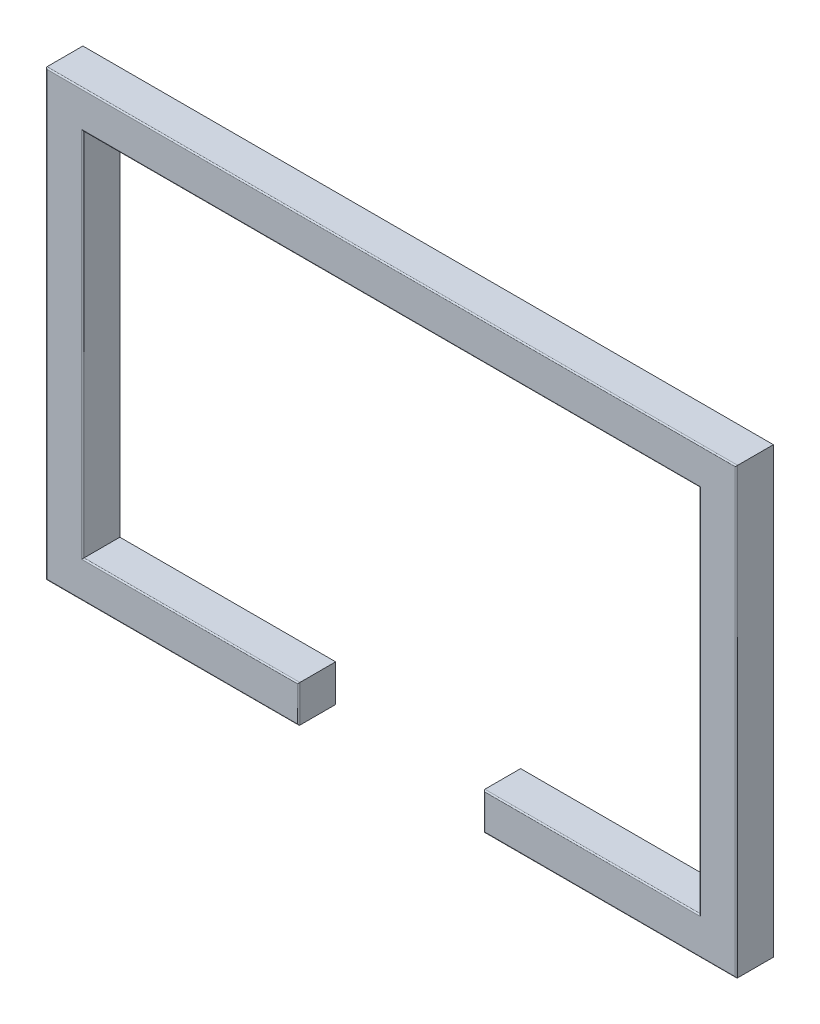
ISO-10303-21;
HEADER;
FILE_DESCRIPTION(('STEP AP214'),'2;1');
FILE_NAME('part.step','',(''),(''),'','','');
FILE_SCHEMA(('AUTOMOTIVE_DESIGN { 1 0 10303 214 1 1 1 1 }'));
ENDSEC;
DATA;
#1=APPLICATION_CONTEXT('core data for automotive mechanical design processes');
#2=APPLICATION_PROTOCOL_DEFINITION('international standard','automotive_design',2000,#1);
#3=PRODUCT_CONTEXT('',#1,'mechanical');
#4=PRODUCT('Part','Part','',(#3));
#5=PRODUCT_RELATED_PRODUCT_CATEGORY('part','',(#4));
#6=PRODUCT_DEFINITION_FORMATION('','',#4);
#7=PRODUCT_DEFINITION_CONTEXT('part definition',#1,'design');
#8=PRODUCT_DEFINITION('design','',#6,#7);
#9=PRODUCT_DEFINITION_SHAPE('','',#8);
#10=(LENGTH_UNIT() NAMED_UNIT(*) SI_UNIT(.MILLI.,.METRE.));
#11=(NAMED_UNIT(*) PLANE_ANGLE_UNIT() SI_UNIT($,.RADIAN.));
#12=(NAMED_UNIT(*) SI_UNIT($,.STERADIAN.) SOLID_ANGLE_UNIT());
#13=UNCERTAINTY_MEASURE_WITH_UNIT(LENGTH_MEASURE(1.E-05),#10,'distance_accuracy_value','');
#14=(GEOMETRIC_REPRESENTATION_CONTEXT(3) GLOBAL_UNCERTAINTY_ASSIGNED_CONTEXT((#13)) GLOBAL_UNIT_ASSIGNED_CONTEXT((#10,
#11,#12)) REPRESENTATION_CONTEXT('',''));
#15=CARTESIAN_POINT('',(0.,0.,0.));
#16=DIRECTION('',(0.,0.,1.));
#17=DIRECTION('',(1.,0.,0.));
#18=AXIS2_PLACEMENT_3D('',#15,#16,#17);
#19=CARTESIAN_POINT('',(75.,-150.,30.));
#20=DIRECTION('',(0.,-1.,0.));
#21=DIRECTION('',(0.,0.,-1.));
#22=AXIS2_PLACEMENT_3D('',#19,#20,#21);
#23=PLANE('',#22);
#24=DIRECTION('',(0.,0.,-1.));
#25=VECTOR('',#24,1.);
#26=CARTESIAN_POINT('',(75.,-150.,30.));
#27=LINE('',#26,#25);
#28=CARTESIAN_POINT('',(75.,-150.,29.));
#29=VERTEX_POINT('',#28);
#30=CARTESIAN_POINT('',(75.,-150.,0.));
#31=VERTEX_POINT('',#30);
#32=EDGE_CURVE('E158',#29,#31,#27,.T.);
#33=ORIENTED_EDGE('',*,*,#32,.F.);
#34=DIRECTION('',(-1.,0.,0.));
#35=VECTOR('',#34,1.);
#36=CARTESIAN_POINT('',(75.,-150.,29.));
#37=LINE('',#36,#35);
#38=CARTESIAN_POINT('',(250.,-150.,29.));
#39=VERTEX_POINT('',#38);
#40=EDGE_CURVE('E270',#29,#39,#37,.F.);
#41=ORIENTED_EDGE('',*,*,#40,.T.);
#42=DIRECTION('',(0.,0.,-1.));
#43=VECTOR('',#42,1.);
#44=CARTESIAN_POINT('',(250.,-150.,30.));
#45=LINE('',#44,#43);
#46=CARTESIAN_POINT('',(250.,-150.,0.));
#47=VERTEX_POINT('',#46);
#48=EDGE_CURVE('E182',#39,#47,#45,.T.);
#49=ORIENTED_EDGE('',*,*,#48,.T.);
#50=DIRECTION('',(-1.,0.,0.));
#51=VECTOR('',#50,1.);
#52=CARTESIAN_POINT('',(75.,-150.,0.));
#53=LINE('',#52,#51);
#54=EDGE_CURVE('E176',#47,#31,#53,.T.);
#55=ORIENTED_EDGE('',*,*,#54,.T.);
#56=EDGE_LOOP('',(#33,#41,#49,#55));
#57=FACE_BOUND('',#56,.T.);
#58=ADVANCED_FACE('F32',(#57),#23,.F.);
#59=CARTESIAN_POINT('',(75.,-180.,30.));
#60=DIRECTION('',(1.,0.,0.));
#61=DIRECTION('',(0.,0.,-1.));
#62=AXIS2_PLACEMENT_3D('',#59,#60,#61);
#63=PLANE('',#62);
#64=DIRECTION('',(0.,0.,-1.));
#65=VECTOR('',#64,1.);
#66=CARTESIAN_POINT('',(75.,-180.,30.));
#67=LINE('',#66,#65);
#68=CARTESIAN_POINT('',(75.,-180.,29.));
#69=VERTEX_POINT('',#68);
#70=CARTESIAN_POINT('',(75.,-180.,0.));
#71=VERTEX_POINT('',#70);
#72=EDGE_CURVE('E170',#69,#71,#67,.T.);
#73=ORIENTED_EDGE('',*,*,#72,.F.);
#74=DIRECTION('',(0.,-1.,0.));
#75=VECTOR('',#74,1.);
#76=CARTESIAN_POINT('',(75.,-180.,29.));
#77=LINE('',#76,#75);
#78=EDGE_CURVE('E165',#69,#29,#77,.F.);
#79=ORIENTED_EDGE('',*,*,#78,.T.);
#80=ORIENTED_EDGE('',*,*,#32,.T.);
#81=DIRECTION('',(0.,-1.,0.));
#82=VECTOR('',#81,1.);
#83=CARTESIAN_POINT('',(75.,-180.,0.));
#84=LINE('',#83,#82);
#85=EDGE_CURVE('E162',#31,#71,#84,.T.);
#86=ORIENTED_EDGE('',*,*,#85,.T.);
#87=EDGE_LOOP('',(#73,#79,#80,#86));
#88=FACE_BOUND('',#87,.T.);
#89=ADVANCED_FACE('F161',(#88),#63,.F.);
#90=CARTESIAN_POINT('',(75.,-180.,30.));
#91=DIRECTION('',(0.,1.,0.));
#92=DIRECTION('',(0.,0.,1.));
#93=AXIS2_PLACEMENT_3D('',#90,#91,#92);
#94=PLANE('',#93);
#95=DIRECTION('',(0.,0.,-1.));
#96=VECTOR('',#95,1.);
#97=CARTESIAN_POINT('',(280.,-180.,30.));
#98=LINE('',#97,#96);
#99=CARTESIAN_POINT('',(280.,-180.,29.));
#100=VERTEX_POINT('',#99);
#101=CARTESIAN_POINT('',(280.,-180.,0.));
#102=VERTEX_POINT('',#101);
#103=EDGE_CURVE('E232',#100,#102,#98,.T.);
#104=ORIENTED_EDGE('',*,*,#103,.F.);
#105=DIRECTION('',(1.,0.,0.));
#106=VECTOR('',#105,1.);
#107=CARTESIAN_POINT('',(75.,-180.,29.));
#108=LINE('',#107,#106);
#109=EDGE_CURVE('E275',#100,#69,#108,.F.);
#110=ORIENTED_EDGE('',*,*,#109,.T.);
#111=ORIENTED_EDGE('',*,*,#72,.T.);
#112=DIRECTION('',(1.,0.,0.));
#113=VECTOR('',#112,1.);
#114=CARTESIAN_POINT('',(75.,-180.,0.));
#115=LINE('',#114,#113);
#116=EDGE_CURVE('E179',#71,#102,#115,.T.);
#117=ORIENTED_EDGE('',*,*,#116,.T.);
#118=EDGE_LOOP('',(#104,#110,#111,#117));
#119=FACE_BOUND('',#118,.T.);
#120=ADVANCED_FACE('F356',(#119),#94,.F.);
#121=CARTESIAN_POINT('',(280.,180.,30.));
#122=DIRECTION('',(-1.,0.,0.));
#123=DIRECTION('',(0.,0.,1.));
#124=AXIS2_PLACEMENT_3D('',#121,#122,#123);
#125=PLANE('',#124);
#126=DIRECTION('',(0.,0.,-1.));
#127=VECTOR('',#126,1.);
#128=CARTESIAN_POINT('',(280.,180.,30.));
#129=LINE('',#128,#127);
#130=CARTESIAN_POINT('',(280.,180.,29.));
#131=VERTEX_POINT('',#130);
#132=CARTESIAN_POINT('',(280.,180.,0.));
#133=VERTEX_POINT('',#132);
#134=EDGE_CURVE('E230',#131,#133,#129,.T.);
#135=ORIENTED_EDGE('',*,*,#134,.F.);
#136=DIRECTION('',(0.,1.,0.));
#137=VECTOR('',#136,1.);
#138=CARTESIAN_POINT('',(280.,180.,29.));
#139=LINE('',#138,#137);
#140=EDGE_CURVE('E273',#131,#100,#139,.F.);
#141=ORIENTED_EDGE('',*,*,#140,.T.);
#142=ORIENTED_EDGE('',*,*,#103,.T.);
#143=DIRECTION('',(0.,1.,0.));
#144=VECTOR('',#143,1.);
#145=CARTESIAN_POINT('',(280.,180.,0.));
#146=LINE('',#145,#144);
#147=EDGE_CURVE('E189',#102,#133,#146,.T.);
#148=ORIENTED_EDGE('',*,*,#147,.T.);
#149=EDGE_LOOP('',(#135,#141,#142,#148));
#150=FACE_BOUND('',#149,.T.);
#151=ADVANCED_FACE('F432',(#150),#125,.F.);
#152=CARTESIAN_POINT('',(-280.,180.,30.));
#153=DIRECTION('',(0.,-1.,0.));
#154=DIRECTION('',(0.,0.,-1.));
#155=AXIS2_PLACEMENT_3D('',#152,#153,#154);
#156=PLANE('',#155);
#157=DIRECTION('',(0.,0.,-1.));
#158=VECTOR('',#157,1.);
#159=CARTESIAN_POINT('',(-280.,180.,30.));
#160=LINE('',#159,#158);
#161=CARTESIAN_POINT('',(-280.,180.,29.));
#162=VERTEX_POINT('',#161);
#163=CARTESIAN_POINT('',(-280.,180.,0.));
#164=VERTEX_POINT('',#163);
#165=EDGE_CURVE('E228',#162,#164,#160,.T.);
#166=ORIENTED_EDGE('',*,*,#165,.F.);
#167=DIRECTION('',(-1.,0.,0.));
#168=VECTOR('',#167,1.);
#169=CARTESIAN_POINT('',(-280.,180.,29.));
#170=LINE('',#169,#168);
#171=EDGE_CURVE('E11',#162,#131,#170,.F.);
#172=ORIENTED_EDGE('',*,*,#171,.T.);
#173=ORIENTED_EDGE('',*,*,#134,.T.);
#174=DIRECTION('',(-1.,0.,0.));
#175=VECTOR('',#174,1.);
#176=CARTESIAN_POINT('',(-280.,180.,0.));
#177=LINE('',#176,#175);
#178=EDGE_CURVE('E192',#133,#164,#177,.T.);
#179=ORIENTED_EDGE('',*,*,#178,.T.);
#180=EDGE_LOOP('',(#166,#172,#173,#179));
#181=FACE_BOUND('',#180,.T.);
#182=ADVANCED_FACE('F429',(#181),#156,.F.);
#183=CARTESIAN_POINT('',(-280.,180.,30.));
#184=DIRECTION('',(1.,0.,0.));
#185=DIRECTION('',(0.,0.,-1.));
#186=AXIS2_PLACEMENT_3D('',#183,#184,#185);
#187=PLANE('',#186);
#188=DIRECTION('',(0.,0.,-1.));
#189=VECTOR('',#188,1.);
#190=CARTESIAN_POINT('',(-280.,-180.,30.));
#191=LINE('',#190,#189);
#192=CARTESIAN_POINT('',(-280.,-180.,29.));
#193=VERTEX_POINT('',#192);
#194=CARTESIAN_POINT('',(-280.,-180.,0.));
#195=VERTEX_POINT('',#194);
#196=EDGE_CURVE('E226',#193,#195,#191,.T.);
#197=ORIENTED_EDGE('',*,*,#196,.F.);
#198=DIRECTION('',(0.,-1.,0.));
#199=VECTOR('',#198,1.);
#200=CARTESIAN_POINT('',(-280.,180.,29.));
#201=LINE('',#200,#199);
#202=EDGE_CURVE('E41',#193,#162,#201,.F.);
#203=ORIENTED_EDGE('',*,*,#202,.T.);
#204=ORIENTED_EDGE('',*,*,#165,.T.);
#205=DIRECTION('',(0.,-1.,0.));
#206=VECTOR('',#205,1.);
#207=CARTESIAN_POINT('',(-280.,180.,0.));
#208=LINE('',#207,#206);
#209=EDGE_CURVE('E195',#164,#195,#208,.T.);
#210=ORIENTED_EDGE('',*,*,#209,.T.);
#211=EDGE_LOOP('',(#197,#203,#204,#210));
#212=FACE_BOUND('',#211,.T.);
#213=ADVANCED_FACE('F427',(#212),#187,.F.);
#214=CARTESIAN_POINT('',(-280.,-180.,30.));
#215=DIRECTION('',(0.,1.,0.));
#216=DIRECTION('',(-1.,0.,0.));
#217=AXIS2_PLACEMENT_3D('',#214,#215,#216);
#218=PLANE('',#217);
#219=DIRECTION('',(0.,0.,-1.));
#220=VECTOR('',#219,1.);
#221=CARTESIAN_POINT('',(-75.,-180.,30.));
#222=LINE('',#221,#220);
#223=CARTESIAN_POINT('',(-75.,-180.,29.));
#224=VERTEX_POINT('',#223);
#225=CARTESIAN_POINT('',(-75.,-180.,0.));
#226=VERTEX_POINT('',#225);
#227=EDGE_CURVE('E224',#224,#226,#222,.T.);
#228=ORIENTED_EDGE('',*,*,#227,.F.);
#229=DIRECTION('',(1.,0.,0.));
#230=VECTOR('',#229,1.);
#231=CARTESIAN_POINT('',(-280.,-180.,29.));
#232=LINE('',#231,#230);
#233=EDGE_CURVE('E56',#224,#193,#232,.F.);
#234=ORIENTED_EDGE('',*,*,#233,.T.);
#235=ORIENTED_EDGE('',*,*,#196,.T.);
#236=DIRECTION('',(1.,0.,0.));
#237=VECTOR('',#236,1.);
#238=CARTESIAN_POINT('',(-280.,-180.,0.));
#239=LINE('',#238,#237);
#240=EDGE_CURVE('E198',#195,#226,#239,.T.);
#241=ORIENTED_EDGE('',*,*,#240,.T.);
#242=EDGE_LOOP('',(#228,#234,#235,#241));
#243=FACE_BOUND('',#242,.T.);
#244=ADVANCED_FACE('F426',(#243),#218,.F.);
#245=CARTESIAN_POINT('',(-75.,-180.,30.));
#246=DIRECTION('',(-1.,0.,0.));
#247=DIRECTION('',(0.,0.,1.));
#248=AXIS2_PLACEMENT_3D('',#245,#246,#247);
#249=PLANE('',#248);
#250=DIRECTION('',(0.,0.,-1.));
#251=VECTOR('',#250,1.);
#252=CARTESIAN_POINT('',(-75.,-150.,30.));
#253=LINE('',#252,#251);
#254=CARTESIAN_POINT('',(-75.,-150.,29.));
#255=VERTEX_POINT('',#254);
#256=CARTESIAN_POINT('',(-75.,-150.,0.));
#257=VERTEX_POINT('',#256);
#258=EDGE_CURVE('E222',#255,#257,#253,.T.);
#259=ORIENTED_EDGE('',*,*,#258,.F.);
#260=DIRECTION('',(0.,1.,0.));
#261=VECTOR('',#260,1.);
#262=CARTESIAN_POINT('',(-75.,-180.,29.));
#263=LINE('',#262,#261);
#264=EDGE_CURVE('E259',#255,#224,#263,.F.);
#265=ORIENTED_EDGE('',*,*,#264,.T.);
#266=ORIENTED_EDGE('',*,*,#227,.T.);
#267=DIRECTION('',(0.,1.,0.));
#268=VECTOR('',#267,1.);
#269=CARTESIAN_POINT('',(-75.,-180.,0.));
#270=LINE('',#269,#268);
#271=EDGE_CURVE('E201',#226,#257,#270,.T.);
#272=ORIENTED_EDGE('',*,*,#271,.T.);
#273=EDGE_LOOP('',(#259,#265,#266,#272));
#274=FACE_BOUND('',#273,.T.);
#275=ADVANCED_FACE('F421',(#274),#249,.F.);
#276=CARTESIAN_POINT('',(-250.,-150.,30.));
#277=DIRECTION('',(0.,-1.,0.));
#278=DIRECTION('',(0.,0.,-1.));
#279=AXIS2_PLACEMENT_3D('',#276,#277,#278);
#280=PLANE('',#279);
#281=DIRECTION('',(0.,0.,-1.));
#282=VECTOR('',#281,1.);
#283=CARTESIAN_POINT('',(-250.,-150.,30.));
#284=LINE('',#283,#282);
#285=CARTESIAN_POINT('',(-250.,-150.,29.));
#286=VERTEX_POINT('',#285);
#287=CARTESIAN_POINT('',(-250.,-150.,0.));
#288=VERTEX_POINT('',#287);
#289=EDGE_CURVE('E220',#286,#288,#284,.T.);
#290=ORIENTED_EDGE('',*,*,#289,.F.);
#291=DIRECTION('',(-1.,0.,0.));
#292=VECTOR('',#291,1.);
#293=CARTESIAN_POINT('',(-250.,-150.,29.));
#294=LINE('',#293,#292);
#295=EDGE_CURVE('E262',#286,#255,#294,.F.);
#296=ORIENTED_EDGE('',*,*,#295,.T.);
#297=ORIENTED_EDGE('',*,*,#258,.T.);
#298=DIRECTION('',(-1.,0.,0.));
#299=VECTOR('',#298,1.);
#300=CARTESIAN_POINT('',(-250.,-150.,0.));
#301=LINE('',#300,#299);
#302=EDGE_CURVE('E204',#257,#288,#301,.T.);
#303=ORIENTED_EDGE('',*,*,#302,.T.);
#304=EDGE_LOOP('',(#290,#296,#297,#303));
#305=FACE_BOUND('',#304,.T.);
#306=ADVANCED_FACE('F419',(#305),#280,.F.);
#307=CARTESIAN_POINT('',(-250.,150.,30.));
#308=DIRECTION('',(-1.,0.,0.));
#309=DIRECTION('',(0.,-1.,0.));
#310=AXIS2_PLACEMENT_3D('',#307,#308,#309);
#311=PLANE('',#310);
#312=DIRECTION('',(0.,0.,-1.));
#313=VECTOR('',#312,1.);
#314=CARTESIAN_POINT('',(-250.,150.,30.));
#315=LINE('',#314,#313);
#316=CARTESIAN_POINT('',(-250.,150.,29.));
#317=VERTEX_POINT('',#316);
#318=CARTESIAN_POINT('',(-250.,150.,0.));
#319=VERTEX_POINT('',#318);
#320=EDGE_CURVE('E218',#317,#319,#315,.T.);
#321=ORIENTED_EDGE('',*,*,#320,.F.);
#322=DIRECTION('',(0.,1.,0.));
#323=VECTOR('',#322,1.);
#324=CARTESIAN_POINT('',(-250.,150.,29.));
#325=LINE('',#324,#323);
#326=EDGE_CURVE('E264',#317,#286,#325,.F.);
#327=ORIENTED_EDGE('',*,*,#326,.T.);
#328=ORIENTED_EDGE('',*,*,#289,.T.);
#329=DIRECTION('',(0.,1.,0.));
#330=VECTOR('',#329,1.);
#331=CARTESIAN_POINT('',(-250.,150.,0.));
#332=LINE('',#331,#330);
#333=EDGE_CURVE('E207',#288,#319,#332,.T.);
#334=ORIENTED_EDGE('',*,*,#333,.T.);
#335=EDGE_LOOP('',(#321,#327,#328,#334));
#336=FACE_BOUND('',#335,.T.);
#337=ADVANCED_FACE('F335',(#336),#311,.F.);
#338=CARTESIAN_POINT('',(-250.,150.,30.));
#339=DIRECTION('',(0.,1.,0.));
#340=DIRECTION('',(0.,0.,1.));
#341=AXIS2_PLACEMENT_3D('',#338,#339,#340);
#342=PLANE('',#341);
#343=DIRECTION('',(0.,0.,-1.));
#344=VECTOR('',#343,1.);
#345=CARTESIAN_POINT('',(250.,150.,30.));
#346=LINE('',#345,#344);
#347=CARTESIAN_POINT('',(250.,150.,29.));
#348=VERTEX_POINT('',#347);
#349=CARTESIAN_POINT('',(250.,150.,0.));
#350=VERTEX_POINT('',#349);
#351=EDGE_CURVE('E216',#348,#350,#346,.T.);
#352=ORIENTED_EDGE('',*,*,#351,.F.);
#353=DIRECTION('',(1.,0.,0.));
#354=VECTOR('',#353,1.);
#355=CARTESIAN_POINT('',(-250.,150.,29.));
#356=LINE('',#355,#354);
#357=EDGE_CURVE('E266',#348,#317,#356,.F.);
#358=ORIENTED_EDGE('',*,*,#357,.T.);
#359=ORIENTED_EDGE('',*,*,#320,.T.);
#360=DIRECTION('',(1.,0.,0.));
#361=VECTOR('',#360,1.);
#362=CARTESIAN_POINT('',(-250.,150.,0.));
#363=LINE('',#362,#361);
#364=EDGE_CURVE('E210',#319,#350,#363,.T.);
#365=ORIENTED_EDGE('',*,*,#364,.T.);
#366=EDGE_LOOP('',(#352,#358,#359,#365));
#367=FACE_BOUND('',#366,.T.);
#368=ADVANCED_FACE('F333',(#367),#342,.F.);
#369=CARTESIAN_POINT('',(250.,150.,30.));
#370=DIRECTION('',(1.,0.,0.));
#371=DIRECTION('',(0.,1.,0.));
#372=AXIS2_PLACEMENT_3D('',#369,#370,#371);
#373=PLANE('',#372);
#374=ORIENTED_EDGE('',*,*,#48,.F.);
#375=DIRECTION('',(0.,-1.,0.));
#376=VECTOR('',#375,1.);
#377=CARTESIAN_POINT('',(250.,150.,29.));
#378=LINE('',#377,#376);
#379=EDGE_CURVE('E268',#39,#348,#378,.F.);
#380=ORIENTED_EDGE('',*,*,#379,.T.);
#381=ORIENTED_EDGE('',*,*,#351,.T.);
#382=DIRECTION('',(0.,-1.,0.));
#383=VECTOR('',#382,1.);
#384=CARTESIAN_POINT('',(250.,150.,0.));
#385=LINE('',#384,#383);
#386=EDGE_CURVE('E213',#350,#47,#385,.T.);
#387=ORIENTED_EDGE('',*,*,#386,.T.);
#388=EDGE_LOOP('',(#374,#380,#381,#387));
#389=FACE_BOUND('',#388,.T.);
#390=ADVANCED_FACE('F341',(#389),#373,.F.);
#391=CARTESIAN_POINT('',(0.,0.,30.));
#392=DIRECTION('',(0.,0.,-1.));
#393=DIRECTION('',(-1.,0.,0.));
#394=AXIS2_PLACEMENT_3D('',#391,#392,#393);
#395=PLANE('',#394);
#396=DIRECTION('',(0.,1.,0.));
#397=VECTOR('',#396,1.);
#398=CARTESIAN_POINT('',(-76.,0.,30.));
#399=LINE('',#398,#397);
#400=CARTESIAN_POINT('',(-76.,-179.,30.));
#401=VERTEX_POINT('',#400);
#402=CARTESIAN_POINT('',(-76.,-151.,30.));
#403=VERTEX_POINT('',#402);
#404=EDGE_CURVE('E242',#401,#403,#399,.T.);
#405=ORIENTED_EDGE('',*,*,#404,.T.);
#406=DIRECTION('',(-1.,0.,0.));
#407=VECTOR('',#406,1.);
#408=CARTESIAN_POINT('',(0.,-151.,30.));
#409=LINE('',#408,#407);
#410=CARTESIAN_POINT('',(-251.,-151.,30.));
#411=VERTEX_POINT('',#410);
#412=EDGE_CURVE('E257',#403,#411,#409,.T.);
#413=ORIENTED_EDGE('',*,*,#412,.T.);
#414=DIRECTION('',(0.,1.,0.));
#415=VECTOR('',#414,1.);
#416=CARTESIAN_POINT('',(-251.,0.,30.));
#417=LINE('',#416,#415);
#418=CARTESIAN_POINT('',(-251.,151.,30.));
#419=VERTEX_POINT('',#418);
#420=EDGE_CURVE('E255',#411,#419,#417,.T.);
#421=ORIENTED_EDGE('',*,*,#420,.T.);
#422=DIRECTION('',(1.,0.,0.));
#423=VECTOR('',#422,1.);
#424=CARTESIAN_POINT('',(0.,151.,30.));
#425=LINE('',#424,#423);
#426=CARTESIAN_POINT('',(251.,151.,30.));
#427=VERTEX_POINT('',#426);
#428=EDGE_CURVE('E253',#419,#427,#425,.T.);
#429=ORIENTED_EDGE('',*,*,#428,.T.);
#430=DIRECTION('',(0.,-1.,0.));
#431=VECTOR('',#430,1.);
#432=CARTESIAN_POINT('',(251.,0.,30.));
#433=LINE('',#432,#431);
#434=CARTESIAN_POINT('',(251.,-151.,30.));
#435=VERTEX_POINT('',#434);
#436=EDGE_CURVE('E251',#427,#435,#433,.T.);
#437=ORIENTED_EDGE('',*,*,#436,.T.);
#438=DIRECTION('',(-1.,0.,0.));
#439=VECTOR('',#438,1.);
#440=CARTESIAN_POINT('',(0.,-151.,30.));
#441=LINE('',#440,#439);
#442=CARTESIAN_POINT('',(76.,-151.,30.));
#443=VERTEX_POINT('',#442);
#444=EDGE_CURVE('E249',#435,#443,#441,.T.);
#445=ORIENTED_EDGE('',*,*,#444,.T.);
#446=DIRECTION('',(0.,-1.,0.));
#447=VECTOR('',#446,1.);
#448=CARTESIAN_POINT('',(76.,0.,30.));
#449=LINE('',#448,#447);
#450=CARTESIAN_POINT('',(76.,-179.,30.));
#451=VERTEX_POINT('',#450);
#452=EDGE_CURVE('E247',#443,#451,#449,.T.);
#453=ORIENTED_EDGE('',*,*,#452,.T.);
#454=DIRECTION('',(1.,0.,0.));
#455=VECTOR('',#454,1.);
#456=CARTESIAN_POINT('',(0.,-179.,30.));
#457=LINE('',#456,#455);
#458=CARTESIAN_POINT('',(279.,-179.,30.));
#459=VERTEX_POINT('',#458);
#460=EDGE_CURVE('E245',#451,#459,#457,.T.);
#461=ORIENTED_EDGE('',*,*,#460,.T.);
#462=DIRECTION('',(0.,1.,0.));
#463=VECTOR('',#462,1.);
#464=CARTESIAN_POINT('',(279.,0.,30.));
#465=LINE('',#464,#463);
#466=CARTESIAN_POINT('',(279.,179.,30.));
#467=VERTEX_POINT('',#466);
#468=EDGE_CURVE('E240',#459,#467,#465,.T.);
#469=ORIENTED_EDGE('',*,*,#468,.T.);
#470=DIRECTION('',(-1.,0.,0.));
#471=VECTOR('',#470,1.);
#472=CARTESIAN_POINT('',(0.,179.,30.));
#473=LINE('',#472,#471);
#474=CARTESIAN_POINT('',(-279.,179.,30.));
#475=VERTEX_POINT('',#474);
#476=EDGE_CURVE('E169',#467,#475,#473,.T.);
#477=ORIENTED_EDGE('',*,*,#476,.T.);
#478=DIRECTION('',(0.,-1.,0.));
#479=VECTOR('',#478,1.);
#480=CARTESIAN_POINT('',(-279.,0.,30.));
#481=LINE('',#480,#479);
#482=CARTESIAN_POINT('',(-279.,-179.,30.));
#483=VERTEX_POINT('',#482);
#484=EDGE_CURVE('E236',#475,#483,#481,.T.);
#485=ORIENTED_EDGE('',*,*,#484,.T.);
#486=DIRECTION('',(1.,0.,0.));
#487=VECTOR('',#486,1.);
#488=CARTESIAN_POINT('',(0.,-179.,30.));
#489=LINE('',#488,#487);
#490=EDGE_CURVE('E238',#483,#401,#489,.T.);
#491=ORIENTED_EDGE('',*,*,#490,.T.);
#492=EDGE_LOOP('',(#405,#413,#421,#429,#437,#445,#453,#461,#469,#477,#485,#491));
#493=FACE_BOUND('',#492,.T.);
#494=ADVANCED_FACE('F317',(#493),#395,.F.);
#495=CARTESIAN_POINT('',(0.,0.,0.));
#496=DIRECTION('',(0.,0.,-1.));
#497=DIRECTION('',(-1.,0.,0.));
#498=AXIS2_PLACEMENT_3D('',#495,#496,#497);
#499=PLANE('',#498);
#500=ORIENTED_EDGE('',*,*,#54,.F.);
#501=ORIENTED_EDGE('',*,*,#386,.F.);
#502=ORIENTED_EDGE('',*,*,#364,.F.);
#503=ORIENTED_EDGE('',*,*,#333,.F.);
#504=ORIENTED_EDGE('',*,*,#302,.F.);
#505=ORIENTED_EDGE('',*,*,#271,.F.);
#506=ORIENTED_EDGE('',*,*,#240,.F.);
#507=ORIENTED_EDGE('',*,*,#209,.F.);
#508=ORIENTED_EDGE('',*,*,#178,.F.);
#509=ORIENTED_EDGE('',*,*,#147,.F.);
#510=ORIENTED_EDGE('',*,*,#116,.F.);
#511=ORIENTED_EDGE('',*,*,#85,.F.);
#512=EDGE_LOOP('',(#500,#501,#502,#503,#504,#505,#506,#507,#508,#509,#510,#511));
#513=FACE_BOUND('',#512,.T.);
#514=ADVANCED_FACE('F174',(#513),#499,.T.);
#515=CARTESIAN_POINT('',(76.,0.,29.));
#516=DIRECTION('',(0.,-1.,0.));
#517=DIRECTION('',(0.,0.,-1.));
#518=AXIS2_PLACEMENT_3D('',#515,#516,#517);
#519=CYLINDRICAL_SURFACE('',#518,1.);
#520=CARTESIAN_POINT('',(76.,-151.,29.));
#521=DIRECTION('',(-0.707106781186547,-0.707106781186547,0.));
#522=DIRECTION('',(0.707106781186547,-0.707106781186547,0.));
#523=AXIS2_PLACEMENT_3D('',#520,#521,#522);
#524=ELLIPSE('',#523,1.41421356237309,1.);
#525=EDGE_CURVE('E186',#29,#443,#524,.F.);
#526=ORIENTED_EDGE('',*,*,#525,.F.);
#527=ORIENTED_EDGE('',*,*,#78,.F.);
#528=CARTESIAN_POINT('',(76.,-179.,29.));
#529=DIRECTION('',(0.707106781186547,-0.707106781186547,0.));
#530=DIRECTION('',(0.707106781186547,0.707106781186547,0.));
#531=AXIS2_PLACEMENT_3D('',#528,#529,#530);
#532=ELLIPSE('',#531,1.41421356237309,1.);
#533=EDGE_CURVE('E36',#451,#69,#532,.T.);
#534=ORIENTED_EDGE('',*,*,#533,.F.);
#535=ORIENTED_EDGE('',*,*,#452,.F.);
#536=EDGE_LOOP('',(#526,#527,#534,#535));
#537=FACE_BOUND('',#536,.T.);
#538=ADVANCED_FACE('F34',(#537),#519,.T.);
#539=CARTESIAN_POINT('',(0.,-179.,29.));
#540=DIRECTION('',(1.,0.,0.));
#541=DIRECTION('',(0.,0.,-1.));
#542=AXIS2_PLACEMENT_3D('',#539,#540,#541);
#543=CYLINDRICAL_SURFACE('',#542,1.);
#544=ORIENTED_EDGE('',*,*,#533,.T.);
#545=ORIENTED_EDGE('',*,*,#109,.F.);
#546=CARTESIAN_POINT('',(279.,-179.,29.));
#547=DIRECTION('',(0.707106781186547,0.707106781186547,0.));
#548=DIRECTION('',(0.707106781186547,-0.707106781186547,0.));
#549=AXIS2_PLACEMENT_3D('',#546,#547,#548);
#550=ELLIPSE('',#549,1.41421356237309,1.);
#551=EDGE_CURVE('E304',#459,#100,#550,.T.);
#552=ORIENTED_EDGE('',*,*,#551,.F.);
#553=ORIENTED_EDGE('',*,*,#460,.F.);
#554=EDGE_LOOP('',(#544,#545,#552,#553));
#555=FACE_BOUND('',#554,.T.);
#556=ADVANCED_FACE('F393',(#555),#543,.T.);
#557=CARTESIAN_POINT('',(0.,-151.,29.));
#558=DIRECTION('',(-1.,0.,0.));
#559=DIRECTION('',(0.,0.,1.));
#560=AXIS2_PLACEMENT_3D('',#557,#558,#559);
#561=CYLINDRICAL_SURFACE('',#560,1.);
#562=ORIENTED_EDGE('',*,*,#525,.T.);
#563=ORIENTED_EDGE('',*,*,#444,.F.);
#564=CARTESIAN_POINT('',(251.,-151.,29.));
#565=DIRECTION('',(-0.707106781186547,-0.707106781186548,0.));
#566=DIRECTION('',(0.707106781186548,-0.707106781186547,0.));
#567=AXIS2_PLACEMENT_3D('',#564,#565,#566);
#568=ELLIPSE('',#567,1.4142135623731,1.);
#569=EDGE_CURVE('E301',#39,#435,#568,.F.);
#570=ORIENTED_EDGE('',*,*,#569,.F.);
#571=ORIENTED_EDGE('',*,*,#40,.F.);
#572=EDGE_LOOP('',(#562,#563,#570,#571));
#573=FACE_BOUND('',#572,.T.);
#574=ADVANCED_FACE('F310',(#573),#561,.T.);
#575=CARTESIAN_POINT('',(279.,0.,29.));
#576=DIRECTION('',(0.,1.,0.));
#577=DIRECTION('',(0.,0.,1.));
#578=AXIS2_PLACEMENT_3D('',#575,#576,#577);
#579=CYLINDRICAL_SURFACE('',#578,1.);
#580=ORIENTED_EDGE('',*,*,#551,.T.);
#581=ORIENTED_EDGE('',*,*,#140,.F.);
#582=CARTESIAN_POINT('',(279.,179.,29.));
#583=DIRECTION('',(-0.707106781186547,0.707106781186547,0.));
#584=DIRECTION('',(-0.707106781186547,-0.707106781186547,0.));
#585=AXIS2_PLACEMENT_3D('',#582,#583,#584);
#586=ELLIPSE('',#585,1.41421356237309,1.);
#587=EDGE_CURVE('E298',#467,#131,#586,.T.);
#588=ORIENTED_EDGE('',*,*,#587,.F.);
#589=ORIENTED_EDGE('',*,*,#468,.F.);
#590=EDGE_LOOP('',(#580,#581,#588,#589));
#591=FACE_BOUND('',#590,.T.);
#592=ADVANCED_FACE('F388',(#591),#579,.T.);
#593=CARTESIAN_POINT('',(251.,0.,29.));
#594=DIRECTION('',(0.,-1.,0.));
#595=DIRECTION('',(1.,0.,0.));
#596=AXIS2_PLACEMENT_3D('',#593,#594,#595);
#597=CYLINDRICAL_SURFACE('',#596,1.);
#598=ORIENTED_EDGE('',*,*,#569,.T.);
#599=ORIENTED_EDGE('',*,*,#436,.F.);
#600=CARTESIAN_POINT('',(251.,151.,29.));
#601=DIRECTION('',(0.707106781186548,-0.707106781186547,0.));
#602=DIRECTION('',(0.707106781186547,0.707106781186548,0.));
#603=AXIS2_PLACEMENT_3D('',#600,#601,#602);
#604=ELLIPSE('',#603,1.41421356237309,1.);
#605=EDGE_CURVE('E295',#348,#427,#604,.F.);
#606=ORIENTED_EDGE('',*,*,#605,.F.);
#607=ORIENTED_EDGE('',*,*,#379,.F.);
#608=EDGE_LOOP('',(#598,#599,#606,#607));
#609=FACE_BOUND('',#608,.T.);
#610=ADVANCED_FACE('F323',(#609),#597,.T.);
#611=CARTESIAN_POINT('',(0.,179.,29.));
#612=DIRECTION('',(-1.,0.,0.));
#613=DIRECTION('',(0.,0.,1.));
#614=AXIS2_PLACEMENT_3D('',#611,#612,#613);
#615=CYLINDRICAL_SURFACE('',#614,1.);
#616=ORIENTED_EDGE('',*,*,#587,.T.);
#617=ORIENTED_EDGE('',*,*,#171,.F.);
#618=CARTESIAN_POINT('',(-279.,179.,29.));
#619=DIRECTION('',(-0.707106781186547,-0.707106781186547,0.));
#620=DIRECTION('',(-0.707106781186547,0.707106781186547,0.));
#621=AXIS2_PLACEMENT_3D('',#618,#619,#620);
#622=ELLIPSE('',#621,1.41421356237309,1.);
#623=EDGE_CURVE('E292',#475,#162,#622,.T.);
#624=ORIENTED_EDGE('',*,*,#623,.F.);
#625=ORIENTED_EDGE('',*,*,#476,.F.);
#626=EDGE_LOOP('',(#616,#617,#624,#625));
#627=FACE_BOUND('',#626,.T.);
#628=ADVANCED_FACE('F382',(#627),#615,.T.);
#629=CARTESIAN_POINT('',(0.,151.,29.));
#630=DIRECTION('',(1.,0.,0.));
#631=DIRECTION('',(0.,0.,-1.));
#632=AXIS2_PLACEMENT_3D('',#629,#630,#631);
#633=CYLINDRICAL_SURFACE('',#632,1.);
#634=ORIENTED_EDGE('',*,*,#605,.T.);
#635=ORIENTED_EDGE('',*,*,#428,.F.);
#636=CARTESIAN_POINT('',(-251.,151.,29.));
#637=DIRECTION('',(0.707106781186547,0.707106781186548,0.));
#638=DIRECTION('',(-0.707106781186548,0.707106781186547,0.));
#639=AXIS2_PLACEMENT_3D('',#636,#637,#638);
#640=ELLIPSE('',#639,1.4142135623731,1.);
#641=EDGE_CURVE('E289',#317,#419,#640,.F.);
#642=ORIENTED_EDGE('',*,*,#641,.F.);
#643=ORIENTED_EDGE('',*,*,#357,.F.);
#644=EDGE_LOOP('',(#634,#635,#642,#643));
#645=FACE_BOUND('',#644,.T.);
#646=ADVANCED_FACE('F327',(#645),#633,.T.);
#647=CARTESIAN_POINT('',(-279.,0.,29.));
#648=DIRECTION('',(0.,-1.,0.));
#649=DIRECTION('',(0.,0.,-1.));
#650=AXIS2_PLACEMENT_3D('',#647,#648,#649);
#651=CYLINDRICAL_SURFACE('',#650,1.);
#652=ORIENTED_EDGE('',*,*,#623,.T.);
#653=ORIENTED_EDGE('',*,*,#202,.F.);
#654=CARTESIAN_POINT('',(-279.,-179.,29.));
#655=DIRECTION('',(0.707106781186547,-0.707106781186548,0.));
#656=DIRECTION('',(-0.707106781186548,-0.707106781186547,0.));
#657=AXIS2_PLACEMENT_3D('',#654,#655,#656);
#658=ELLIPSE('',#657,1.41421356237309,1.);
#659=EDGE_CURVE('E286',#483,#193,#658,.T.);
#660=ORIENTED_EDGE('',*,*,#659,.F.);
#661=ORIENTED_EDGE('',*,*,#484,.F.);
#662=EDGE_LOOP('',(#652,#653,#660,#661));
#663=FACE_BOUND('',#662,.T.);
#664=ADVANCED_FACE('F375',(#663),#651,.T.);
#665=CARTESIAN_POINT('',(-251.,0.,29.));
#666=DIRECTION('',(0.,1.,0.));
#667=DIRECTION('',(-1.,0.,0.));
#668=AXIS2_PLACEMENT_3D('',#665,#666,#667);
#669=CYLINDRICAL_SURFACE('',#668,1.);
#670=ORIENTED_EDGE('',*,*,#641,.T.);
#671=ORIENTED_EDGE('',*,*,#420,.F.);
#672=CARTESIAN_POINT('',(-251.,-151.,29.));
#673=DIRECTION('',(-0.707106781186548,0.707106781186547,0.));
#674=DIRECTION('',(-0.707106781186547,-0.707106781186548,0.));
#675=AXIS2_PLACEMENT_3D('',#672,#673,#674);
#676=ELLIPSE('',#675,1.41421356237309,1.);
#677=EDGE_CURVE('E283',#286,#411,#676,.F.);
#678=ORIENTED_EDGE('',*,*,#677,.F.);
#679=ORIENTED_EDGE('',*,*,#326,.F.);
#680=EDGE_LOOP('',(#670,#671,#678,#679));
#681=FACE_BOUND('',#680,.T.);
#682=ADVANCED_FACE('F371',(#681),#669,.T.);
#683=CARTESIAN_POINT('',(0.,-179.,29.));
#684=DIRECTION('',(1.,0.,0.));
#685=DIRECTION('',(0.,1.,0.));
#686=AXIS2_PLACEMENT_3D('',#683,#684,#685);
#687=CYLINDRICAL_SURFACE('',#686,1.);
#688=ORIENTED_EDGE('',*,*,#659,.T.);
#689=ORIENTED_EDGE('',*,*,#233,.F.);
#690=CARTESIAN_POINT('',(-76.,-179.,29.));
#691=DIRECTION('',(0.707106781186548,0.707106781186547,0.));
#692=DIRECTION('',(0.707106781186547,-0.707106781186548,0.));
#693=AXIS2_PLACEMENT_3D('',#690,#691,#692);
#694=ELLIPSE('',#693,1.4142135623731,1.);
#695=EDGE_CURVE('E281',#401,#224,#694,.T.);
#696=ORIENTED_EDGE('',*,*,#695,.F.);
#697=ORIENTED_EDGE('',*,*,#490,.F.);
#698=EDGE_LOOP('',(#688,#689,#696,#697));
#699=FACE_BOUND('',#698,.T.);
#700=ADVANCED_FACE('F367',(#699),#687,.T.);
#701=CARTESIAN_POINT('',(0.,-151.,29.));
#702=DIRECTION('',(-1.,0.,0.));
#703=DIRECTION('',(0.,0.,1.));
#704=AXIS2_PLACEMENT_3D('',#701,#702,#703);
#705=CYLINDRICAL_SURFACE('',#704,1.);
#706=ORIENTED_EDGE('',*,*,#677,.T.);
#707=ORIENTED_EDGE('',*,*,#412,.F.);
#708=CARTESIAN_POINT('',(-76.,-151.,29.));
#709=DIRECTION('',(-0.707106781186547,0.707106781186547,0.));
#710=DIRECTION('',(-0.707106781186547,-0.707106781186547,0.));
#711=AXIS2_PLACEMENT_3D('',#708,#709,#710);
#712=ELLIPSE('',#711,1.41421356237309,1.);
#713=EDGE_CURVE('E279',#255,#403,#712,.F.);
#714=ORIENTED_EDGE('',*,*,#713,.F.);
#715=ORIENTED_EDGE('',*,*,#295,.F.);
#716=EDGE_LOOP('',(#706,#707,#714,#715));
#717=FACE_BOUND('',#716,.T.);
#718=ADVANCED_FACE('F363',(#717),#705,.T.);
#719=CARTESIAN_POINT('',(-76.,0.,29.));
#720=DIRECTION('',(0.,1.,0.));
#721=DIRECTION('',(0.,0.,1.));
#722=AXIS2_PLACEMENT_3D('',#719,#720,#721);
#723=CYLINDRICAL_SURFACE('',#722,1.);
#724=ORIENTED_EDGE('',*,*,#695,.T.);
#725=ORIENTED_EDGE('',*,*,#264,.F.);
#726=ORIENTED_EDGE('',*,*,#713,.T.);
#727=ORIENTED_EDGE('',*,*,#404,.F.);
#728=EDGE_LOOP('',(#724,#725,#726,#727));
#729=FACE_BOUND('',#728,.T.);
#730=ADVANCED_FACE('F360',(#729),#723,.T.);
#731=CLOSED_SHELL('',(#58,#89,#120,#151,#182,#213,#244,#275,#306,#337,#368,#390,#494,#514,#538,
#556,#574,#592,#610,#628,#646,#664,#682,#700,#718,#730));
#732=MANIFOLD_SOLID_BREP('B2',#731);
#733=ADVANCED_BREP_SHAPE_REPRESENTATION('',(#18,#732),#14);
#734=SHAPE_DEFINITION_REPRESENTATION(#9,#733);
ENDSEC;
END-ISO-10303-21;
